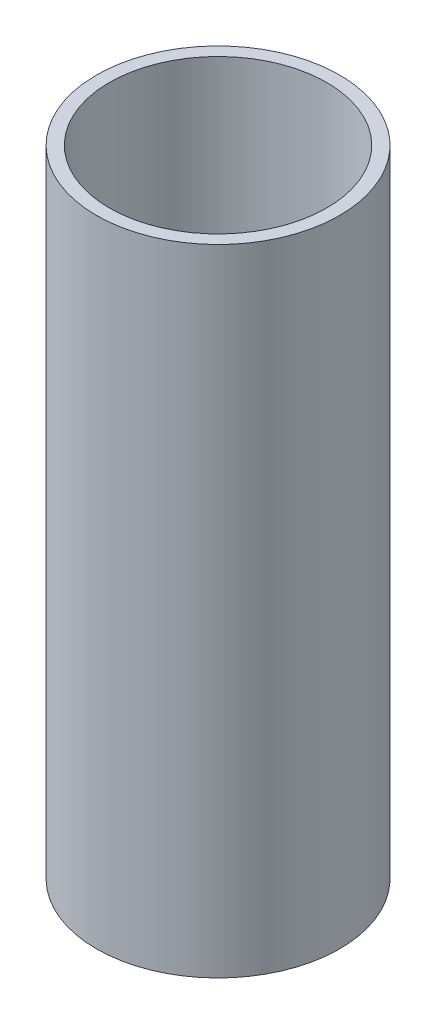
ISO-10303-21;
HEADER;
FILE_DESCRIPTION(('STEP AP214'),'2;1');
FILE_NAME('part.step','',(''),(''),'','','');
FILE_SCHEMA(('AUTOMOTIVE_DESIGN { 1 0 10303 214 1 1 1 1 }'));
ENDSEC;
DATA;
#1=APPLICATION_CONTEXT('core data for automotive mechanical design processes');
#2=APPLICATION_PROTOCOL_DEFINITION('international standard','automotive_design',2000,#1);
#3=PRODUCT_CONTEXT('',#1,'mechanical');
#4=PRODUCT('Part','Part','',(#3));
#5=PRODUCT_RELATED_PRODUCT_CATEGORY('part','',(#4));
#6=PRODUCT_DEFINITION_FORMATION('','',#4);
#7=PRODUCT_DEFINITION_CONTEXT('part definition',#1,'design');
#8=PRODUCT_DEFINITION('design','',#6,#7);
#9=PRODUCT_DEFINITION_SHAPE('','',#8);
#10=(LENGTH_UNIT() NAMED_UNIT(*) SI_UNIT(.MILLI.,.METRE.));
#11=(NAMED_UNIT(*) PLANE_ANGLE_UNIT() SI_UNIT($,.RADIAN.));
#12=(NAMED_UNIT(*) SI_UNIT($,.STERADIAN.) SOLID_ANGLE_UNIT());
#13=UNCERTAINTY_MEASURE_WITH_UNIT(LENGTH_MEASURE(1.E-05),#10,'distance_accuracy_value','');
#14=(GEOMETRIC_REPRESENTATION_CONTEXT(3) GLOBAL_UNCERTAINTY_ASSIGNED_CONTEXT((#13)) GLOBAL_UNIT_ASSIGNED_CONTEXT((#10,
#11,#12)) REPRESENTATION_CONTEXT('',''));
#15=CARTESIAN_POINT('',(0.,0.,0.));
#16=DIRECTION('',(0.,0.,1.));
#17=DIRECTION('',(1.,0.,0.));
#18=AXIS2_PLACEMENT_3D('',#15,#16,#17);
#19=CARTESIAN_POINT('',(0.,208.926332131021,0.));
#20=DIRECTION('',(0.,-1.,0.));
#21=DIRECTION('',(0.,0.,-1.));
#22=AXIS2_PLACEMENT_3D('',#19,#20,#21);
#23=CYLINDRICAL_SURFACE('',#22,40.);
#24=CARTESIAN_POINT('',(0.,208.926332131021,0.));
#25=DIRECTION('',(0.,1.,0.));
#26=DIRECTION('',(0.,0.,1.));
#27=AXIS2_PLACEMENT_3D('',#24,#25,#26);
#28=CIRCLE('',#27,40.);
#29=CARTESIAN_POINT('',(0.,208.926332131021,40.));
#30=VERTEX_POINT('',#29);
#31=EDGE_CURVE('E10',#30,#30,#28,.T.);
#32=ORIENTED_EDGE('',*,*,#31,.F.);
#33=EDGE_LOOP('',(#32));
#34=FACE_BOUND('',#33,.T.);
#35=CARTESIAN_POINT('',(0.,0.,0.));
#36=DIRECTION('',(0.,1.,0.));
#37=DIRECTION('',(0.,0.,1.));
#38=AXIS2_PLACEMENT_3D('',#35,#36,#37);
#39=CIRCLE('',#38,40.);
#40=CARTESIAN_POINT('',(0.,0.,40.));
#41=VERTEX_POINT('',#40);
#42=EDGE_CURVE('E37',#41,#41,#39,.T.);
#43=ORIENTED_EDGE('',*,*,#42,.T.);
#44=EDGE_LOOP('',(#43));
#45=FACE_BOUND('',#44,.T.);
#46=ADVANCED_FACE('F40',(#34,#45),#23,.T.);
#47=CARTESIAN_POINT('',(0.,208.926332131021,0.));
#48=DIRECTION('',(0.,1.,0.));
#49=DIRECTION('',(0.,0.,1.));
#50=AXIS2_PLACEMENT_3D('',#47,#48,#49);
#51=PLANE('',#50);
#52=CARTESIAN_POINT('',(0.,208.926332131021,0.));
#53=DIRECTION('',(0.,1.,0.));
#54=DIRECTION('',(0.,0.,1.));
#55=AXIS2_PLACEMENT_3D('',#52,#53,#54);
#56=CIRCLE('',#55,35.7524076541894);
#57=CARTESIAN_POINT('',(0.,208.926332131021,35.7524076541894));
#58=VERTEX_POINT('',#57);
#59=EDGE_CURVE('E50',#58,#58,#56,.T.);
#60=ORIENTED_EDGE('',*,*,#59,.F.);
#61=EDGE_LOOP('',(#60));
#62=FACE_BOUND('',#61,.T.);
#63=ORIENTED_EDGE('',*,*,#31,.T.);
#64=EDGE_LOOP('',(#63));
#65=FACE_BOUND('',#64,.T.);
#66=ADVANCED_FACE('F59',(#62,#65),#51,.T.);
#67=CARTESIAN_POINT('',(0.,0.,0.));
#68=DIRECTION('',(0.,1.,0.));
#69=DIRECTION('',(0.,0.,1.));
#70=AXIS2_PLACEMENT_3D('',#67,#68,#69);
#71=PLANE('',#70);
#72=CARTESIAN_POINT('',(0.,0.,0.));
#73=DIRECTION('',(0.,1.,0.));
#74=DIRECTION('',(0.,0.,1.));
#75=AXIS2_PLACEMENT_3D('',#72,#73,#74);
#76=CIRCLE('',#75,35.7524076541894);
#77=CARTESIAN_POINT('',(0.,0.,35.7524076541894));
#78=VERTEX_POINT('',#77);
#79=EDGE_CURVE('E47',#78,#78,#76,.T.);
#80=ORIENTED_EDGE('',*,*,#79,.T.);
#81=EDGE_LOOP('',(#80));
#82=FACE_BOUND('',#81,.T.);
#83=ORIENTED_EDGE('',*,*,#42,.F.);
#84=EDGE_LOOP('',(#83));
#85=FACE_BOUND('',#84,.T.);
#86=ADVANCED_FACE('F58',(#82,#85),#71,.F.);
#87=CARTESIAN_POINT('',(0.,208.926332131021,0.));
#88=DIRECTION('',(0.,-1.,0.));
#89=DIRECTION('',(0.,0.,-1.));
#90=AXIS2_PLACEMENT_3D('',#87,#88,#89);
#91=CYLINDRICAL_SURFACE('',#90,35.7524076541894);
#92=ORIENTED_EDGE('',*,*,#59,.T.);
#93=EDGE_LOOP('',(#92));
#94=FACE_BOUND('',#93,.T.);
#95=ORIENTED_EDGE('',*,*,#79,.F.);
#96=EDGE_LOOP('',(#95));
#97=FACE_BOUND('',#96,.T.);
#98=ADVANCED_FACE('F54',(#94,#97),#91,.F.);
#99=CLOSED_SHELL('',(#46,#66,#86,#98));
#100=MANIFOLD_SOLID_BREP('B2',#99);
#101=ADVANCED_BREP_SHAPE_REPRESENTATION('',(#18,#100),#14);
#102=SHAPE_DEFINITION_REPRESENTATION(#9,#101);
ENDSEC;
END-ISO-10303-21;
